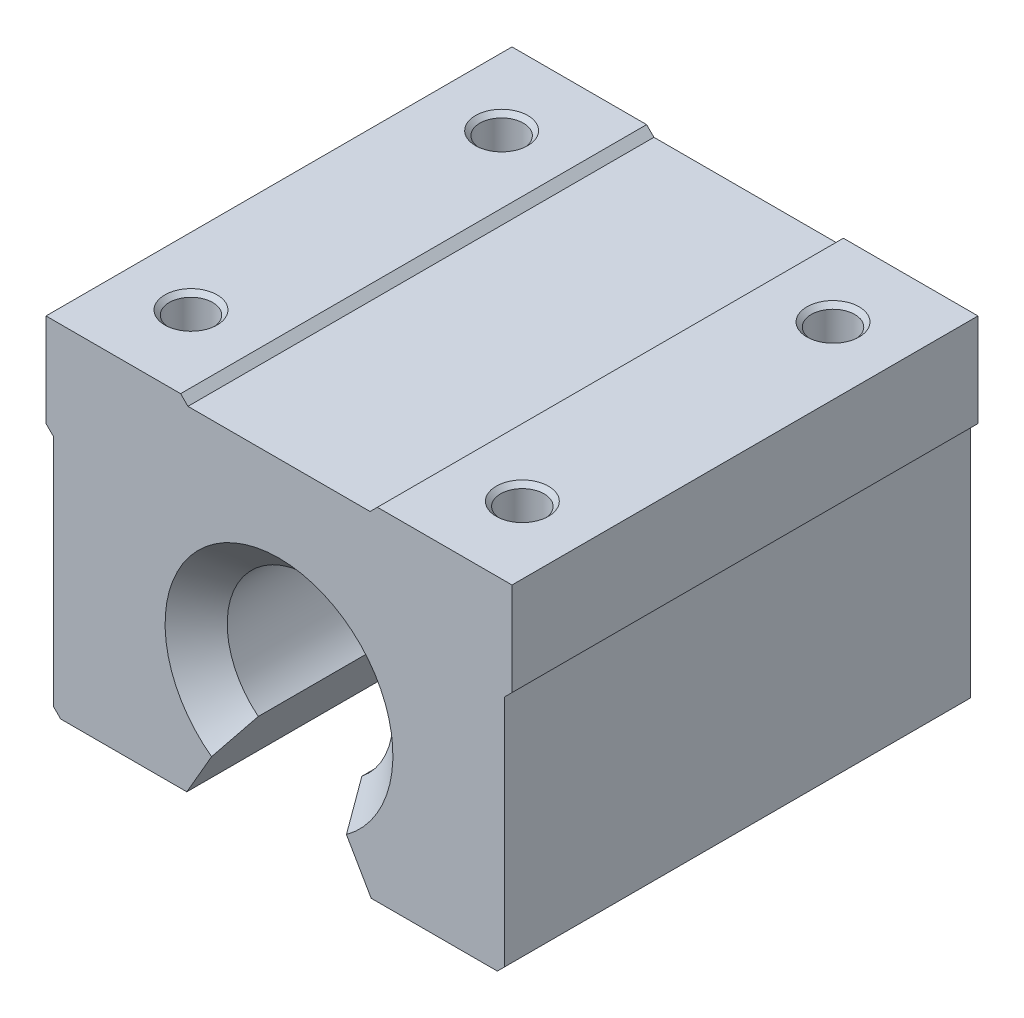
ISO-10303-21;
HEADER;
FILE_DESCRIPTION(('STEP AP214'),'2;1');
FILE_NAME('part.step','',(''),(''),'','','');
FILE_SCHEMA(('AUTOMOTIVE_DESIGN { 1 0 10303 214 1 1 1 1 }'));
ENDSEC;
DATA;
#1=APPLICATION_CONTEXT('core data for automotive mechanical design processes');
#2=APPLICATION_PROTOCOL_DEFINITION('international standard','automotive_design',2000,#1);
#3=PRODUCT_CONTEXT('',#1,'mechanical');
#4=PRODUCT('Part','Part','',(#3));
#5=PRODUCT_RELATED_PRODUCT_CATEGORY('part','',(#4));
#6=PRODUCT_DEFINITION_FORMATION('','',#4);
#7=PRODUCT_DEFINITION_CONTEXT('part definition',#1,'design');
#8=PRODUCT_DEFINITION('design','',#6,#7);
#9=PRODUCT_DEFINITION_SHAPE('','',#8);
#10=(LENGTH_UNIT() NAMED_UNIT(*) SI_UNIT(.MILLI.,.METRE.));
#11=(NAMED_UNIT(*) PLANE_ANGLE_UNIT() SI_UNIT($,.RADIAN.));
#12=(NAMED_UNIT(*) SI_UNIT($,.STERADIAN.) SOLID_ANGLE_UNIT());
#13=UNCERTAINTY_MEASURE_WITH_UNIT(LENGTH_MEASURE(1.E-05),#10,'distance_accuracy_value','');
#14=(GEOMETRIC_REPRESENTATION_CONTEXT(3) GLOBAL_UNCERTAINTY_ASSIGNED_CONTEXT((#13)) GLOBAL_UNIT_ASSIGNED_CONTEXT((#10,
#11,#12)) REPRESENTATION_CONTEXT('',''));
#15=CARTESIAN_POINT('',(0.,0.,0.));
#16=DIRECTION('',(0.,0.,1.));
#17=DIRECTION('',(1.,0.,0.));
#18=AXIS2_PLACEMENT_3D('',#15,#16,#17);
#19=CARTESIAN_POINT('',(-22.5,20.,22.5));
#20=DIRECTION('',(0.,-1.,0.));
#21=DIRECTION('',(0.,0.,-1.));
#22=AXIS2_PLACEMENT_3D('',#19,#20,#21);
#23=PLANE('',#22);
#24=CARTESIAN_POINT('',(-16.,20.,-15.));
#25=DIRECTION('',(0.,1.,0.));
#26=DIRECTION('',(0.,0.,1.));
#27=AXIS2_PLACEMENT_3D('',#24,#25,#26);
#28=CIRCLE('',#27,2.525);
#29=CARTESIAN_POINT('',(-16.,20.,-12.475));
#30=VERTEX_POINT('',#29);
#31=EDGE_CURVE('E220',#30,#30,#28,.T.);
#32=ORIENTED_EDGE('',*,*,#31,.F.);
#33=EDGE_LOOP('',(#32));
#34=FACE_BOUND('',#33,.T.);
#35=CARTESIAN_POINT('',(-16.,20.,15.));
#36=DIRECTION('',(0.,1.,0.));
#37=DIRECTION('',(0.,0.,1.));
#38=AXIS2_PLACEMENT_3D('',#35,#36,#37);
#39=CIRCLE('',#38,2.525);
#40=CARTESIAN_POINT('',(-16.,20.,17.525));
#41=VERTEX_POINT('',#40);
#42=EDGE_CURVE('E229',#41,#41,#39,.T.);
#43=ORIENTED_EDGE('',*,*,#42,.F.);
#44=EDGE_LOOP('',(#43));
#45=FACE_BOUND('',#44,.T.);
#46=DIRECTION('',(-1.,0.,0.));
#47=VECTOR('',#46,1.);
#48=CARTESIAN_POINT('',(-22.5,20.,-22.5));
#49=LINE('',#48,#47);
#50=CARTESIAN_POINT('',(-9.5,20.,-22.5));
#51=VERTEX_POINT('',#50);
#52=CARTESIAN_POINT('',(-22.5,20.,-22.5));
#53=VERTEX_POINT('',#52);
#54=EDGE_CURVE('E238',#51,#53,#49,.T.);
#55=ORIENTED_EDGE('',*,*,#54,.T.);
#56=DIRECTION('',(0.,0.,-1.));
#57=VECTOR('',#56,1.);
#58=CARTESIAN_POINT('',(-22.5,20.,22.5));
#59=LINE('',#58,#57);
#60=CARTESIAN_POINT('',(-22.5,20.,22.5));
#61=VERTEX_POINT('',#60);
#62=EDGE_CURVE('E359',#61,#53,#59,.T.);
#63=ORIENTED_EDGE('',*,*,#62,.F.);
#64=DIRECTION('',(-1.,0.,0.));
#65=VECTOR('',#64,1.);
#66=CARTESIAN_POINT('',(-22.5,20.,22.5));
#67=LINE('',#66,#65);
#68=CARTESIAN_POINT('',(-9.5,20.,22.5));
#69=VERTEX_POINT('',#68);
#70=EDGE_CURVE('E239',#69,#61,#67,.T.);
#71=ORIENTED_EDGE('',*,*,#70,.F.);
#72=DIRECTION('',(0.,0.,-1.));
#73=VECTOR('',#72,1.);
#74=CARTESIAN_POINT('',(-9.5,20.,22.5));
#75=LINE('',#74,#73);
#76=EDGE_CURVE('E275',#69,#51,#75,.T.);
#77=ORIENTED_EDGE('',*,*,#76,.T.);
#78=EDGE_LOOP('',(#55,#63,#71,#77));
#79=FACE_BOUND('',#78,.T.);
#80=ADVANCED_FACE('F41',(#34,#45,#79),#23,.F.);
#81=CARTESIAN_POINT('',(-22.5,20.,22.5));
#82=DIRECTION('',(1.,0.,0.));
#83=DIRECTION('',(0.,0.,-1.));
#84=AXIS2_PLACEMENT_3D('',#81,#82,#83);
#85=PLANE('',#84);
#86=DIRECTION('',(0.,-1.,0.));
#87=VECTOR('',#86,1.);
#88=CARTESIAN_POINT('',(-22.5,20.,-22.5));
#89=LINE('',#88,#87);
#90=CARTESIAN_POINT('',(-22.5,11.,-22.5));
#91=VERTEX_POINT('',#90);
#92=EDGE_CURVE('E278',#53,#91,#89,.T.);
#93=ORIENTED_EDGE('',*,*,#92,.T.);
#94=DIRECTION('',(0.,0.,-1.));
#95=VECTOR('',#94,1.);
#96=CARTESIAN_POINT('',(-22.5,11.,22.5));
#97=LINE('',#96,#95);
#98=CARTESIAN_POINT('',(-22.5,11.,22.5));
#99=VERTEX_POINT('',#98);
#100=EDGE_CURVE('E356',#99,#91,#97,.T.);
#101=ORIENTED_EDGE('',*,*,#100,.F.);
#102=DIRECTION('',(0.,-1.,0.));
#103=VECTOR('',#102,1.);
#104=CARTESIAN_POINT('',(-22.5,20.,22.5));
#105=LINE('',#104,#103);
#106=EDGE_CURVE('E242',#61,#99,#105,.T.);
#107=ORIENTED_EDGE('',*,*,#106,.F.);
#108=ORIENTED_EDGE('',*,*,#62,.T.);
#109=EDGE_LOOP('',(#93,#101,#107,#108));
#110=FACE_BOUND('',#109,.T.);
#111=ADVANCED_FACE('F421',(#110),#85,.F.);
#112=CARTESIAN_POINT('',(-22.5,11.,22.5));
#113=DIRECTION('',(0.707106781186546,0.707106781186549,0.));
#114=DIRECTION('',(-0.707106781186549,0.707106781186546,0.));
#115=AXIS2_PLACEMENT_3D('',#112,#113,#114);
#116=PLANE('',#115);
#117=DIRECTION('',(0.707106781186549,-0.707106781186546,0.));
#118=VECTOR('',#117,1.);
#119=CARTESIAN_POINT('',(-22.5,11.,-22.5));
#120=LINE('',#119,#118);
#121=CARTESIAN_POINT('',(-21.7928932188135,10.2928932188135,-22.5));
#122=VERTEX_POINT('',#121);
#123=EDGE_CURVE('E280',#91,#122,#120,.T.);
#124=ORIENTED_EDGE('',*,*,#123,.T.);
#125=DIRECTION('',(0.,0.,-1.));
#126=VECTOR('',#125,1.);
#127=CARTESIAN_POINT('',(-21.7928932188135,10.2928932188135,22.5));
#128=LINE('',#127,#126);
#129=CARTESIAN_POINT('',(-21.7928932188135,10.2928932188135,22.5));
#130=VERTEX_POINT('',#129);
#131=EDGE_CURVE('E353',#130,#122,#128,.T.);
#132=ORIENTED_EDGE('',*,*,#131,.F.);
#133=DIRECTION('',(0.707106781186549,-0.707106781186546,0.));
#134=VECTOR('',#133,1.);
#135=CARTESIAN_POINT('',(-22.5,11.,22.5));
#136=LINE('',#135,#134);
#137=EDGE_CURVE('E245',#99,#130,#136,.T.);
#138=ORIENTED_EDGE('',*,*,#137,.F.);
#139=ORIENTED_EDGE('',*,*,#100,.T.);
#140=EDGE_LOOP('',(#124,#132,#138,#139));
#141=FACE_BOUND('',#140,.T.);
#142=ADVANCED_FACE('F425',(#141),#116,.F.);
#143=CARTESIAN_POINT('',(-21.7928932188135,10.2928932188135,22.5));
#144=DIRECTION('',(1.,0.,0.));
#145=DIRECTION('',(0.,1.,0.));
#146=AXIS2_PLACEMENT_3D('',#143,#144,#145);
#147=PLANE('',#146);
#148=DIRECTION('',(0.,-1.,0.));
#149=VECTOR('',#148,1.);
#150=CARTESIAN_POINT('',(-21.7928932188135,10.2928932188135,-22.5));
#151=LINE('',#150,#149);
#152=CARTESIAN_POINT('',(-21.7928932188134,-12.2928932188135,-22.5));
#153=VERTEX_POINT('',#152);
#154=EDGE_CURVE('E282',#122,#153,#151,.T.);
#155=ORIENTED_EDGE('',*,*,#154,.T.);
#156=DIRECTION('',(0.,0.,-1.));
#157=VECTOR('',#156,1.);
#158=CARTESIAN_POINT('',(-21.7928932188134,-12.2928932188135,22.5));
#159=LINE('',#158,#157);
#160=CARTESIAN_POINT('',(-21.7928932188134,-12.2928932188135,22.5));
#161=VERTEX_POINT('',#160);
#162=EDGE_CURVE('E350',#161,#153,#159,.T.);
#163=ORIENTED_EDGE('',*,*,#162,.F.);
#164=DIRECTION('',(0.,-1.,0.));
#165=VECTOR('',#164,1.);
#166=CARTESIAN_POINT('',(-21.7928932188135,10.2928932188135,22.5));
#167=LINE('',#166,#165);
#168=EDGE_CURVE('E247',#130,#161,#167,.T.);
#169=ORIENTED_EDGE('',*,*,#168,.F.);
#170=ORIENTED_EDGE('',*,*,#131,.T.);
#171=EDGE_LOOP('',(#155,#163,#169,#170));
#172=FACE_BOUND('',#171,.T.);
#173=ADVANCED_FACE('F429',(#172),#147,.F.);
#174=CARTESIAN_POINT('',(-21.7928932188134,-12.2928932188135,22.5));
#175=DIRECTION('',(0.707106781186542,0.707106781186553,0.));
#176=DIRECTION('',(-0.707106781186553,0.707106781186542,0.));
#177=AXIS2_PLACEMENT_3D('',#174,#175,#176);
#178=PLANE('',#177);
#179=DIRECTION('',(0.707106781186553,-0.707106781186542,0.));
#180=VECTOR('',#179,1.);
#181=CARTESIAN_POINT('',(-21.7928932188134,-12.2928932188135,-22.5));
#182=LINE('',#181,#180);
#183=CARTESIAN_POINT('',(-21.0857864376269,-13.,-22.5));
#184=VERTEX_POINT('',#183);
#185=EDGE_CURVE('E284',#153,#184,#182,.T.);
#186=ORIENTED_EDGE('',*,*,#185,.T.);
#187=DIRECTION('',(0.,0.,-1.));
#188=VECTOR('',#187,1.);
#189=CARTESIAN_POINT('',(-21.0857864376269,-13.,22.5));
#190=LINE('',#189,#188);
#191=CARTESIAN_POINT('',(-21.0857864376269,-13.,22.5));
#192=VERTEX_POINT('',#191);
#193=EDGE_CURVE('E347',#192,#184,#190,.T.);
#194=ORIENTED_EDGE('',*,*,#193,.F.);
#195=DIRECTION('',(0.707106781186553,-0.707106781186542,0.));
#196=VECTOR('',#195,1.);
#197=CARTESIAN_POINT('',(-21.7928932188134,-12.2928932188135,22.5));
#198=LINE('',#197,#196);
#199=EDGE_CURVE('E249',#161,#192,#198,.T.);
#200=ORIENTED_EDGE('',*,*,#199,.F.);
#201=ORIENTED_EDGE('',*,*,#162,.T.);
#202=EDGE_LOOP('',(#186,#194,#200,#201));
#203=FACE_BOUND('',#202,.T.);
#204=ADVANCED_FACE('F432',(#203),#178,.F.);
#205=CARTESIAN_POINT('',(-21.0857864376269,-13.,22.5));
#206=DIRECTION('',(0.,1.,0.));
#207=DIRECTION('',(-1.,0.,0.));
#208=AXIS2_PLACEMENT_3D('',#205,#206,#207);
#209=PLANE('',#208);
#210=DIRECTION('',(1.,0.,0.));
#211=VECTOR('',#210,1.);
#212=CARTESIAN_POINT('',(-21.0857864376269,-13.,-22.5));
#213=LINE('',#212,#211);
#214=CARTESIAN_POINT('',(-8.90000222400116,-13.,-22.5));
#215=VERTEX_POINT('',#214);
#216=EDGE_CURVE('E286',#184,#215,#213,.T.);
#217=ORIENTED_EDGE('',*,*,#216,.T.);
#218=DIRECTION('',(0.,0.,-1.));
#219=VECTOR('',#218,1.);
#220=CARTESIAN_POINT('',(-8.90000222400116,-13.,22.5));
#221=LINE('',#220,#219);
#222=CARTESIAN_POINT('',(-8.90000222400116,-13.,22.5));
#223=VERTEX_POINT('',#222);
#224=EDGE_CURVE('E344',#223,#215,#221,.T.);
#225=ORIENTED_EDGE('',*,*,#224,.F.);
#226=DIRECTION('',(1.,0.,0.));
#227=VECTOR('',#226,1.);
#228=CARTESIAN_POINT('',(-21.0857864376269,-13.,22.5));
#229=LINE('',#228,#227);
#230=EDGE_CURVE('E251',#192,#223,#229,.T.);
#231=ORIENTED_EDGE('',*,*,#230,.F.);
#232=ORIENTED_EDGE('',*,*,#193,.T.);
#233=EDGE_LOOP('',(#217,#225,#231,#232));
#234=FACE_BOUND('',#233,.T.);
#235=ADVANCED_FACE('F397',(#234),#209,.F.);
#236=CARTESIAN_POINT('',(-8.90000222400116,-13.,22.5));
#237=DIRECTION('',(-0.866025403784438,0.500000000000001,0.));
#238=DIRECTION('',(-0.500000000000001,-0.866025403784438,0.));
#239=AXIS2_PLACEMENT_3D('',#236,#237,#238);
#240=PLANE('',#239);
#241=DIRECTION('',(0.500000000000001,0.866025403784438,0.));
#242=VECTOR('',#241,1.);
#243=CARTESIAN_POINT('',(-8.90000222400116,-13.,-22.5));
#244=LINE('',#243,#242);
#245=CARTESIAN_POINT('',(-6.51259139811201,-8.86488315102003,-22.5));
#246=VERTEX_POINT('',#245);
#247=EDGE_CURVE('E288',#215,#246,#244,.T.);
#248=ORIENTED_EDGE('',*,*,#247,.T.);
#249=CARTESIAN_POINT('',(-6.51259139811201,-8.86488315102003,-22.5));
#250=CARTESIAN_POINT('',(-6.38668504007308,-8.64680694190066,-22.2497118828855));
#251=CARTESIAN_POINT('',(-6.26075386517851,-8.42868774872641,-21.9994736753837));
#252=CARTESIAN_POINT('',(-6.00882674626239,-7.99233717895925,-21.4991279368277));
#253=CARTESIAN_POINT('',(-5.88283080226974,-7.77410580241637,-21.2490204057154));
#254=CARTESIAN_POINT('',(-5.63075887329718,-7.33750441427402,-20.7489666059144));
#255=CARTESIAN_POINT('',(-5.50468288830189,-7.11913440264788,-20.4990203372568));
#256=CARTESIAN_POINT('',(-5.25242616501369,-6.68221294136187,-19.999339119979));
#257=CARTESIAN_POINT('',(-5.12624542667377,-6.46366149162057,-19.7496041714537));
#258=CARTESIAN_POINT('',(-5.,-6.2449979983984,-19.5));
#259=B_SPLINE_CURVE_WITH_KNOTS('',3,(#249,#250,#251,#252,#253,#254,#255,#256,#257,#258),
.UNSPECIFIED.,.F.,.F.,(4,2,2,2,4),(0.,1.06512164089084,2.13024280709936,3.19536417823267,
4.26048602769983),.UNSPECIFIED.);
#260=CARTESIAN_POINT('',(-5.,-6.2449979983984,-19.4999999999999));
#261=VERTEX_POINT('',#260);
#262=EDGE_CURVE('E51',#246,#261,#259,.T.);
#263=ORIENTED_EDGE('',*,*,#262,.T.);
#264=DIRECTION('',(0.,0.,-1.));
#265=VECTOR('',#264,1.);
#266=CARTESIAN_POINT('',(-5.,-6.2449979983984,22.5));
#267=LINE('',#266,#265);
#268=CARTESIAN_POINT('',(-5.,-6.2449979983984,19.5));
#269=VERTEX_POINT('',#268);
#270=EDGE_CURVE('E341',#269,#261,#267,.T.);
#271=ORIENTED_EDGE('',*,*,#270,.F.);
#272=CARTESIAN_POINT('',(-5.,-6.2449979983984,19.5));
#273=CARTESIAN_POINT('',(-5.12624542667376,-6.46366149162056,19.7496041714537));
#274=CARTESIAN_POINT('',(-5.25242616501368,-6.68221294136186,19.999339119979));
#275=CARTESIAN_POINT('',(-5.50468288830188,-7.11913440264785,20.4990203372568));
#276=CARTESIAN_POINT('',(-5.63075887329716,-7.33750441427398,20.7489666059144));
#277=CARTESIAN_POINT('',(-5.88283080226971,-7.77410580241632,21.2490204057154));
#278=CARTESIAN_POINT('',(-6.00882674626236,-7.99233717895919,21.4991279368278));
#279=CARTESIAN_POINT('',(-6.26075386517847,-8.42868774872634,21.9994736753837));
#280=CARTESIAN_POINT('',(-6.38668504007304,-8.64680694190058,22.2497118828855));
#281=CARTESIAN_POINT('',(-6.51259139811196,-8.86488315101994,22.5));
#282=B_SPLINE_CURVE_WITH_KNOTS('',3,(#272,#273,#274,#275,#276,#277,#278,#279,#280,#281),
.UNSPECIFIED.,.F.,.F.,(4,2,2,2,4),(0.,1.06512184946713,2.13024322060042,3.1953643868089,
4.26048602769971),.UNSPECIFIED.);
#283=CARTESIAN_POINT('',(-6.51259139811196,-8.86488315101994,22.5));
#284=VERTEX_POINT('',#283);
#285=EDGE_CURVE('E58',#269,#284,#282,.T.);
#286=ORIENTED_EDGE('',*,*,#285,.T.);
#287=DIRECTION('',(0.500000000000001,0.866025403784438,0.));
#288=VECTOR('',#287,1.);
#289=CARTESIAN_POINT('',(-8.90000222400116,-13.,22.5));
#290=LINE('',#289,#288);
#291=EDGE_CURVE('E253',#223,#284,#290,.T.);
#292=ORIENTED_EDGE('',*,*,#291,.F.);
#293=ORIENTED_EDGE('',*,*,#224,.T.);
#294=EDGE_LOOP('',(#248,#263,#271,#286,#292,#293));
#295=FACE_BOUND('',#294,.T.);
#296=ADVANCED_FACE('F392',(#295),#240,.F.);
#297=CARTESIAN_POINT('',(0.,0.,22.5));
#298=DIRECTION('',(0.,0.,-1.));
#299=DIRECTION('',(-1.,0.,0.));
#300=AXIS2_PLACEMENT_3D('',#297,#298,#299);
#301=CYLINDRICAL_SURFACE('',#300,8.);
#302=ORIENTED_EDGE('',*,*,#270,.T.);
#303=CARTESIAN_POINT('',(0.,0.,-19.5));
#304=DIRECTION('',(0.,0.,1.));
#305=DIRECTION('',(1.,0.,0.));
#306=AXIS2_PLACEMENT_3D('',#303,#304,#305);
#307=CIRCLE('',#306,8.);
#308=CARTESIAN_POINT('',(5.,-6.2449979983984,-19.4999999999999));
#309=VERTEX_POINT('',#308);
#310=EDGE_CURVE('E364',#261,#309,#307,.F.);
#311=ORIENTED_EDGE('',*,*,#310,.T.);
#312=DIRECTION('',(0.,0.,-1.));
#313=VECTOR('',#312,1.);
#314=CARTESIAN_POINT('',(5.,-6.2449979983984,22.5));
#315=LINE('',#314,#313);
#316=CARTESIAN_POINT('',(5.,-6.2449979983984,19.5));
#317=VERTEX_POINT('',#316);
#318=EDGE_CURVE('E338',#317,#309,#315,.T.);
#319=ORIENTED_EDGE('',*,*,#318,.F.);
#320=CARTESIAN_POINT('',(0.,0.,19.5));
#321=DIRECTION('',(0.,0.,1.));
#322=DIRECTION('',(1.,0.,0.));
#323=AXIS2_PLACEMENT_3D('',#320,#321,#322);
#324=CIRCLE('',#323,8.);
#325=EDGE_CURVE('E362',#317,#269,#324,.T.);
#326=ORIENTED_EDGE('',*,*,#325,.T.);
#327=EDGE_LOOP('',(#302,#311,#319,#326));
#328=FACE_BOUND('',#327,.T.);
#329=ADVANCED_FACE('F386',(#328),#301,.F.);
#330=CARTESIAN_POINT('',(8.90000222400116,-13.,22.5));
#331=DIRECTION('',(0.866025403784438,0.500000000000001,0.));
#332=DIRECTION('',(-0.500000000000001,0.866025403784438,0.));
#333=AXIS2_PLACEMENT_3D('',#330,#331,#332);
#334=PLANE('',#333);
#335=ORIENTED_EDGE('',*,*,#318,.T.);
#336=CARTESIAN_POINT('',(5.,-6.2449979983984,-19.5));
#337=CARTESIAN_POINT('',(5.12624542667376,-6.46366149162057,-19.7496041714537));
#338=CARTESIAN_POINT('',(5.25242616501369,-6.68221294136187,-19.999339119979));
#339=CARTESIAN_POINT('',(5.50468288830189,-7.11913440264788,-20.4990203372568));
#340=CARTESIAN_POINT('',(5.63075887329718,-7.33750441427402,-20.7489666059144));
#341=CARTESIAN_POINT('',(5.88283080226974,-7.77410580241637,-21.2490204057154));
#342=CARTESIAN_POINT('',(6.00882674626239,-7.99233717895925,-21.4991279368277));
#343=CARTESIAN_POINT('',(6.26075386517851,-8.42868774872641,-21.9994736753837));
#344=CARTESIAN_POINT('',(6.38668504007309,-8.64680694190066,-22.2497118828855));
#345=CARTESIAN_POINT('',(6.51259139811201,-8.86488315102003,-22.5));
#346=B_SPLINE_CURVE_WITH_KNOTS('',3,(#336,#337,#338,#339,#340,#341,#342,#343,#344,#345),
.UNSPECIFIED.,.F.,.F.,(4,2,2,2,4),(0.,1.06512184946717,2.13024322060048,3.19536438680899,
4.26048602769984),.UNSPECIFIED.);
#347=CARTESIAN_POINT('',(6.51259139811201,-8.86488315102003,-22.5));
#348=VERTEX_POINT('',#347);
#349=EDGE_CURVE('E374',#309,#348,#346,.T.);
#350=ORIENTED_EDGE('',*,*,#349,.T.);
#351=DIRECTION('',(0.500000000000001,-0.866025403784438,0.));
#352=VECTOR('',#351,1.);
#353=CARTESIAN_POINT('',(8.90000222400116,-13.,-22.5));
#354=LINE('',#353,#352);
#355=CARTESIAN_POINT('',(8.90000222400116,-13.,-22.5));
#356=VERTEX_POINT('',#355);
#357=EDGE_CURVE('E290',#348,#356,#354,.T.);
#358=ORIENTED_EDGE('',*,*,#357,.T.);
#359=DIRECTION('',(0.,0.,-1.));
#360=VECTOR('',#359,1.);
#361=CARTESIAN_POINT('',(8.90000222400116,-13.,22.5));
#362=LINE('',#361,#360);
#363=CARTESIAN_POINT('',(8.90000222400116,-13.,22.5));
#364=VERTEX_POINT('',#363);
#365=EDGE_CURVE('E335',#364,#356,#362,.T.);
#366=ORIENTED_EDGE('',*,*,#365,.F.);
#367=DIRECTION('',(0.500000000000001,-0.866025403784438,0.));
#368=VECTOR('',#367,1.);
#369=CARTESIAN_POINT('',(8.90000222400116,-13.,22.5));
#370=LINE('',#369,#368);
#371=CARTESIAN_POINT('',(6.51259139811196,-8.86488315101994,22.5));
#372=VERTEX_POINT('',#371);
#373=EDGE_CURVE('E255',#372,#364,#370,.T.);
#374=ORIENTED_EDGE('',*,*,#373,.F.);
#375=CARTESIAN_POINT('',(6.51259139811196,-8.86488315101994,22.5));
#376=CARTESIAN_POINT('',(6.38668504007304,-8.64680694190058,22.2497118828855));
#377=CARTESIAN_POINT('',(6.26075386517847,-8.42868774872634,21.9994736753837));
#378=CARTESIAN_POINT('',(6.00882674626236,-7.99233717895919,21.4991279368278));
#379=CARTESIAN_POINT('',(5.88283080226971,-7.77410580241632,21.2490204057154));
#380=CARTESIAN_POINT('',(5.63075887329716,-7.33750441427398,20.7489666059144));
#381=CARTESIAN_POINT('',(5.50468288830187,-7.11913440264785,20.4990203372568));
#382=CARTESIAN_POINT('',(5.25242616501368,-6.68221294136186,19.999339119979));
#383=CARTESIAN_POINT('',(5.12624542667376,-6.46366149162056,19.7496041714537));
#384=CARTESIAN_POINT('',(5.,-6.2449979983984,19.5));
#385=B_SPLINE_CURVE_WITH_KNOTS('',3,(#375,#376,#377,#378,#379,#380,#381,#382,#383,#384),
.UNSPECIFIED.,.F.,.F.,(4,2,2,2,4),(0.,1.06512164089081,2.1302428070993,3.19536417823258,
4.26048602769971),.UNSPECIFIED.);
#386=EDGE_CURVE('E367',#372,#317,#385,.T.);
#387=ORIENTED_EDGE('',*,*,#386,.T.);
#388=EDGE_LOOP('',(#335,#350,#358,#366,#374,#387));
#389=FACE_BOUND('',#388,.T.);
#390=ADVANCED_FACE('F380',(#389),#334,.F.);
#391=CARTESIAN_POINT('',(21.0857864376269,-13.,22.5));
#392=DIRECTION('',(0.,1.,0.));
#393=DIRECTION('',(-1.,0.,0.));
#394=AXIS2_PLACEMENT_3D('',#391,#392,#393);
#395=PLANE('',#394);
#396=DIRECTION('',(1.,0.,0.));
#397=VECTOR('',#396,1.);
#398=CARTESIAN_POINT('',(21.0857864376269,-13.,-22.5));
#399=LINE('',#398,#397);
#400=CARTESIAN_POINT('',(21.0857864376269,-13.,-22.5));
#401=VERTEX_POINT('',#400);
#402=EDGE_CURVE('E292',#356,#401,#399,.T.);
#403=ORIENTED_EDGE('',*,*,#402,.T.);
#404=DIRECTION('',(0.,0.,-1.));
#405=VECTOR('',#404,1.);
#406=CARTESIAN_POINT('',(21.0857864376269,-13.,22.5));
#407=LINE('',#406,#405);
#408=CARTESIAN_POINT('',(21.0857864376269,-13.,22.5));
#409=VERTEX_POINT('',#408);
#410=EDGE_CURVE('E332',#409,#401,#407,.T.);
#411=ORIENTED_EDGE('',*,*,#410,.F.);
#412=DIRECTION('',(1.,0.,0.));
#413=VECTOR('',#412,1.);
#414=CARTESIAN_POINT('',(21.0857864376269,-13.,22.5));
#415=LINE('',#414,#413);
#416=EDGE_CURVE('E257',#364,#409,#415,.T.);
#417=ORIENTED_EDGE('',*,*,#416,.F.);
#418=ORIENTED_EDGE('',*,*,#365,.T.);
#419=EDGE_LOOP('',(#403,#411,#417,#418));
#420=FACE_BOUND('',#419,.T.);
#421=ADVANCED_FACE('F385',(#420),#395,.F.);
#422=CARTESIAN_POINT('',(21.7928932188134,-12.2928932188135,22.5));
#423=DIRECTION('',(-0.707106781186544,0.707106781186551,0.));
#424=DIRECTION('',(-0.707106781186551,-0.707106781186544,0.));
#425=AXIS2_PLACEMENT_3D('',#422,#423,#424);
#426=PLANE('',#425);
#427=DIRECTION('',(0.707106781186551,0.707106781186544,0.));
#428=VECTOR('',#427,1.);
#429=CARTESIAN_POINT('',(21.7928932188134,-12.2928932188135,-22.5));
#430=LINE('',#429,#428);
#431=CARTESIAN_POINT('',(21.7928932188134,-12.2928932188135,-22.5));
#432=VERTEX_POINT('',#431);
#433=EDGE_CURVE('E294',#401,#432,#430,.T.);
#434=ORIENTED_EDGE('',*,*,#433,.T.);
#435=DIRECTION('',(0.,0.,-1.));
#436=VECTOR('',#435,1.);
#437=CARTESIAN_POINT('',(21.7928932188134,-12.2928932188135,22.5));
#438=LINE('',#437,#436);
#439=CARTESIAN_POINT('',(21.7928932188134,-12.2928932188135,22.5));
#440=VERTEX_POINT('',#439);
#441=EDGE_CURVE('E329',#440,#432,#438,.T.);
#442=ORIENTED_EDGE('',*,*,#441,.F.);
#443=DIRECTION('',(0.707106781186551,0.707106781186544,0.));
#444=VECTOR('',#443,1.);
#445=CARTESIAN_POINT('',(21.7928932188134,-12.2928932188135,22.5));
#446=LINE('',#445,#444);
#447=EDGE_CURVE('E259',#409,#440,#446,.T.);
#448=ORIENTED_EDGE('',*,*,#447,.F.);
#449=ORIENTED_EDGE('',*,*,#410,.T.);
#450=EDGE_LOOP('',(#434,#442,#448,#449));
#451=FACE_BOUND('',#450,.T.);
#452=ADVANCED_FACE('F508',(#451),#426,.F.);
#453=CARTESIAN_POINT('',(21.7928932188135,10.2928932188135,22.5));
#454=DIRECTION('',(-1.,0.,0.));
#455=DIRECTION('',(0.,-1.,0.));
#456=AXIS2_PLACEMENT_3D('',#453,#454,#455);
#457=PLANE('',#456);
#458=DIRECTION('',(0.,1.,0.));
#459=VECTOR('',#458,1.);
#460=CARTESIAN_POINT('',(21.7928932188135,10.2928932188135,-22.5));
#461=LINE('',#460,#459);
#462=CARTESIAN_POINT('',(21.7928932188135,10.2928932188135,-22.5));
#463=VERTEX_POINT('',#462);
#464=EDGE_CURVE('E296',#432,#463,#461,.T.);
#465=ORIENTED_EDGE('',*,*,#464,.T.);
#466=DIRECTION('',(0.,0.,-1.));
#467=VECTOR('',#466,1.);
#468=CARTESIAN_POINT('',(21.7928932188135,10.2928932188135,22.5));
#469=LINE('',#468,#467);
#470=CARTESIAN_POINT('',(21.7928932188135,10.2928932188135,22.5));
#471=VERTEX_POINT('',#470);
#472=EDGE_CURVE('E326',#471,#463,#469,.T.);
#473=ORIENTED_EDGE('',*,*,#472,.F.);
#474=DIRECTION('',(0.,1.,0.));
#475=VECTOR('',#474,1.);
#476=CARTESIAN_POINT('',(21.7928932188135,10.2928932188135,22.5));
#477=LINE('',#476,#475);
#478=EDGE_CURVE('E261',#440,#471,#477,.T.);
#479=ORIENTED_EDGE('',*,*,#478,.F.);
#480=ORIENTED_EDGE('',*,*,#441,.T.);
#481=EDGE_LOOP('',(#465,#473,#479,#480));
#482=FACE_BOUND('',#481,.T.);
#483=ADVANCED_FACE('F503',(#482),#457,.F.);
#484=CARTESIAN_POINT('',(22.5,11.,22.5));
#485=DIRECTION('',(-0.707106781186546,0.707106781186549,0.));
#486=DIRECTION('',(-0.707106781186549,-0.707106781186546,0.));
#487=AXIS2_PLACEMENT_3D('',#484,#485,#486);
#488=PLANE('',#487);
#489=DIRECTION('',(0.707106781186549,0.707106781186546,0.));
#490=VECTOR('',#489,1.);
#491=CARTESIAN_POINT('',(22.5,11.,-22.5));
#492=LINE('',#491,#490);
#493=CARTESIAN_POINT('',(22.5,11.,-22.5));
#494=VERTEX_POINT('',#493);
#495=EDGE_CURVE('E298',#463,#494,#492,.T.);
#496=ORIENTED_EDGE('',*,*,#495,.T.);
#497=DIRECTION('',(0.,0.,-1.));
#498=VECTOR('',#497,1.);
#499=CARTESIAN_POINT('',(22.5,11.,22.5));
#500=LINE('',#499,#498);
#501=CARTESIAN_POINT('',(22.5,11.,22.5));
#502=VERTEX_POINT('',#501);
#503=EDGE_CURVE('E323',#502,#494,#500,.T.);
#504=ORIENTED_EDGE('',*,*,#503,.F.);
#505=DIRECTION('',(0.707106781186549,0.707106781186546,0.));
#506=VECTOR('',#505,1.);
#507=CARTESIAN_POINT('',(22.5,11.,22.5));
#508=LINE('',#507,#506);
#509=EDGE_CURVE('E263',#471,#502,#508,.T.);
#510=ORIENTED_EDGE('',*,*,#509,.F.);
#511=ORIENTED_EDGE('',*,*,#472,.T.);
#512=EDGE_LOOP('',(#496,#504,#510,#511));
#513=FACE_BOUND('',#512,.T.);
#514=ADVANCED_FACE('F497',(#513),#488,.F.);
#515=CARTESIAN_POINT('',(22.5,20.,22.5));
#516=DIRECTION('',(-1.,0.,0.));
#517=DIRECTION('',(0.,0.,1.));
#518=AXIS2_PLACEMENT_3D('',#515,#516,#517);
#519=PLANE('',#518);
#520=DIRECTION('',(0.,1.,0.));
#521=VECTOR('',#520,1.);
#522=CARTESIAN_POINT('',(22.5,20.,-22.5));
#523=LINE('',#522,#521);
#524=CARTESIAN_POINT('',(22.5,20.,-22.5));
#525=VERTEX_POINT('',#524);
#526=EDGE_CURVE('E300',#494,#525,#523,.T.);
#527=ORIENTED_EDGE('',*,*,#526,.T.);
#528=DIRECTION('',(0.,0.,-1.));
#529=VECTOR('',#528,1.);
#530=CARTESIAN_POINT('',(22.5,20.,22.5));
#531=LINE('',#530,#529);
#532=CARTESIAN_POINT('',(22.5,20.,22.5));
#533=VERTEX_POINT('',#532);
#534=EDGE_CURVE('E320',#533,#525,#531,.T.);
#535=ORIENTED_EDGE('',*,*,#534,.F.);
#536=DIRECTION('',(0.,1.,0.));
#537=VECTOR('',#536,1.);
#538=CARTESIAN_POINT('',(22.5,20.,22.5));
#539=LINE('',#538,#537);
#540=EDGE_CURVE('E265',#502,#533,#539,.T.);
#541=ORIENTED_EDGE('',*,*,#540,.F.);
#542=ORIENTED_EDGE('',*,*,#503,.T.);
#543=EDGE_LOOP('',(#527,#535,#541,#542));
#544=FACE_BOUND('',#543,.T.);
#545=ADVANCED_FACE('F493',(#544),#519,.F.);
#546=CARTESIAN_POINT('',(22.5,20.,22.5));
#547=DIRECTION('',(0.,-1.,0.));
#548=DIRECTION('',(0.,0.,-1.));
#549=AXIS2_PLACEMENT_3D('',#546,#547,#548);
#550=PLANE('',#549);
#551=CARTESIAN_POINT('',(16.,20.,15.));
#552=DIRECTION('',(0.,1.,0.));
#553=DIRECTION('',(0.,0.,1.));
#554=AXIS2_PLACEMENT_3D('',#551,#552,#553);
#555=CIRCLE('',#554,2.525);
#556=CARTESIAN_POINT('',(16.,20.,17.525));
#557=VERTEX_POINT('',#556);
#558=EDGE_CURVE('E211',#557,#557,#555,.T.);
#559=ORIENTED_EDGE('',*,*,#558,.F.);
#560=EDGE_LOOP('',(#559));
#561=FACE_BOUND('',#560,.T.);
#562=CARTESIAN_POINT('',(16.,20.,-15.));
#563=DIRECTION('',(0.,1.,0.));
#564=DIRECTION('',(0.,0.,1.));
#565=AXIS2_PLACEMENT_3D('',#562,#563,#564);
#566=CIRCLE('',#565,2.525);
#567=CARTESIAN_POINT('',(16.,20.,-12.475));
#568=VERTEX_POINT('',#567);
#569=EDGE_CURVE('E204',#568,#568,#566,.T.);
#570=ORIENTED_EDGE('',*,*,#569,.F.);
#571=EDGE_LOOP('',(#570));
#572=FACE_BOUND('',#571,.T.);
#573=DIRECTION('',(-1.,0.,0.));
#574=VECTOR('',#573,1.);
#575=CARTESIAN_POINT('',(22.5,20.,-22.5));
#576=LINE('',#575,#574);
#577=CARTESIAN_POINT('',(9.5,20.,-22.5));
#578=VERTEX_POINT('',#577);
#579=EDGE_CURVE('E302',#525,#578,#576,.T.);
#580=ORIENTED_EDGE('',*,*,#579,.T.);
#581=DIRECTION('',(0.,0.,-1.));
#582=VECTOR('',#581,1.);
#583=CARTESIAN_POINT('',(9.5,20.,22.5));
#584=LINE('',#583,#582);
#585=CARTESIAN_POINT('',(9.5,20.,22.5));
#586=VERTEX_POINT('',#585);
#587=EDGE_CURVE('E317',#586,#578,#584,.T.);
#588=ORIENTED_EDGE('',*,*,#587,.F.);
#589=DIRECTION('',(-1.,0.,0.));
#590=VECTOR('',#589,1.);
#591=CARTESIAN_POINT('',(22.5,20.,22.5));
#592=LINE('',#591,#590);
#593=EDGE_CURVE('E267',#533,#586,#592,.T.);
#594=ORIENTED_EDGE('',*,*,#593,.F.);
#595=ORIENTED_EDGE('',*,*,#534,.T.);
#596=EDGE_LOOP('',(#580,#588,#594,#595));
#597=FACE_BOUND('',#596,.T.);
#598=ADVANCED_FACE('F488',(#561,#572,#597),#550,.F.);
#599=CARTESIAN_POINT('',(9.5,20.,22.5));
#600=DIRECTION('',(0.707106781186547,-0.707106781186548,0.));
#601=DIRECTION('',(0.707106781186548,0.707106781186547,0.));
#602=AXIS2_PLACEMENT_3D('',#599,#600,#601);
#603=PLANE('',#602);
#604=DIRECTION('',(-0.707106781186548,-0.707106781186547,0.));
#605=VECTOR('',#604,1.);
#606=CARTESIAN_POINT('',(9.5,20.,-22.5));
#607=LINE('',#606,#605);
#608=CARTESIAN_POINT('',(8.79289321881345,19.2928932188134,-22.5));
#609=VERTEX_POINT('',#608);
#610=EDGE_CURVE('E304',#578,#609,#607,.T.);
#611=ORIENTED_EDGE('',*,*,#610,.T.);
#612=DIRECTION('',(0.,0.,-1.));
#613=VECTOR('',#612,1.);
#614=CARTESIAN_POINT('',(8.79289321881345,19.2928932188134,22.5));
#615=LINE('',#614,#613);
#616=CARTESIAN_POINT('',(8.79289321881345,19.2928932188134,22.5));
#617=VERTEX_POINT('',#616);
#618=EDGE_CURVE('E314',#617,#609,#615,.T.);
#619=ORIENTED_EDGE('',*,*,#618,.F.);
#620=DIRECTION('',(-0.707106781186548,-0.707106781186547,0.));
#621=VECTOR('',#620,1.);
#622=CARTESIAN_POINT('',(9.5,20.,22.5));
#623=LINE('',#622,#621);
#624=EDGE_CURVE('E269',#586,#617,#623,.T.);
#625=ORIENTED_EDGE('',*,*,#624,.F.);
#626=ORIENTED_EDGE('',*,*,#587,.T.);
#627=EDGE_LOOP('',(#611,#619,#625,#626));
#628=FACE_BOUND('',#627,.T.);
#629=ADVANCED_FACE('F482',(#628),#603,.F.);
#630=CARTESIAN_POINT('',(-8.79289321881345,19.2928932188134,22.5));
#631=DIRECTION('',(0.,-1.,0.));
#632=DIRECTION('',(0.,0.,-1.));
#633=AXIS2_PLACEMENT_3D('',#630,#631,#632);
#634=PLANE('',#633);
#635=DIRECTION('',(-1.,0.,0.));
#636=VECTOR('',#635,1.);
#637=CARTESIAN_POINT('',(-8.79289321881345,19.2928932188134,-22.5));
#638=LINE('',#637,#636);
#639=CARTESIAN_POINT('',(-8.79289321881345,19.2928932188134,-22.5));
#640=VERTEX_POINT('',#639);
#641=EDGE_CURVE('E306',#609,#640,#638,.T.);
#642=ORIENTED_EDGE('',*,*,#641,.T.);
#643=DIRECTION('',(0.,0.,-1.));
#644=VECTOR('',#643,1.);
#645=CARTESIAN_POINT('',(-8.79289321881345,19.2928932188134,22.5));
#646=LINE('',#645,#644);
#647=CARTESIAN_POINT('',(-8.79289321881345,19.2928932188134,22.5));
#648=VERTEX_POINT('',#647);
#649=EDGE_CURVE('E311',#648,#640,#646,.T.);
#650=ORIENTED_EDGE('',*,*,#649,.F.);
#651=DIRECTION('',(-1.,0.,0.));
#652=VECTOR('',#651,1.);
#653=CARTESIAN_POINT('',(-8.79289321881345,19.2928932188134,22.5));
#654=LINE('',#653,#652);
#655=EDGE_CURVE('E271',#617,#648,#654,.T.);
#656=ORIENTED_EDGE('',*,*,#655,.F.);
#657=ORIENTED_EDGE('',*,*,#618,.T.);
#658=EDGE_LOOP('',(#642,#650,#656,#657));
#659=FACE_BOUND('',#658,.T.);
#660=ADVANCED_FACE('F478',(#659),#634,.F.);
#661=CARTESIAN_POINT('',(-9.5,20.,22.5));
#662=DIRECTION('',(-0.707106781186547,-0.707106781186548,0.));
#663=DIRECTION('',(0.707106781186548,-0.707106781186547,0.));
#664=AXIS2_PLACEMENT_3D('',#661,#662,#663);
#665=PLANE('',#664);
#666=DIRECTION('',(-0.707106781186548,0.707106781186547,0.));
#667=VECTOR('',#666,1.);
#668=CARTESIAN_POINT('',(-9.5,20.,-22.5));
#669=LINE('',#668,#667);
#670=EDGE_CURVE('E243',#640,#51,#669,.T.);
#671=ORIENTED_EDGE('',*,*,#670,.T.);
#672=ORIENTED_EDGE('',*,*,#76,.F.);
#673=DIRECTION('',(-0.707106781186548,0.707106781186547,0.));
#674=VECTOR('',#673,1.);
#675=CARTESIAN_POINT('',(-9.5,20.,22.5));
#676=LINE('',#675,#674);
#677=EDGE_CURVE('E273',#648,#69,#676,.T.);
#678=ORIENTED_EDGE('',*,*,#677,.F.);
#679=ORIENTED_EDGE('',*,*,#649,.T.);
#680=EDGE_LOOP('',(#671,#672,#678,#679));
#681=FACE_BOUND('',#680,.T.);
#682=ADVANCED_FACE('F473',(#681),#665,.F.);
#683=CARTESIAN_POINT('',(0.,0.,22.5));
#684=DIRECTION('',(0.,0.,1.));
#685=DIRECTION('',(1.,0.,0.));
#686=AXIS2_PLACEMENT_3D('',#683,#684,#685);
#687=PLANE('',#686);
#688=ORIENTED_EDGE('',*,*,#291,.T.);
#689=CARTESIAN_POINT('',(0.,0.,22.5));
#690=DIRECTION('',(0.,0.,1.));
#691=DIRECTION('',(1.,0.,0.));
#692=AXIS2_PLACEMENT_3D('',#689,#690,#691);
#693=CIRCLE('',#692,11.);
#694=EDGE_CURVE('E11',#284,#372,#693,.F.);
#695=ORIENTED_EDGE('',*,*,#694,.T.);
#696=ORIENTED_EDGE('',*,*,#373,.T.);
#697=ORIENTED_EDGE('',*,*,#416,.T.);
#698=ORIENTED_EDGE('',*,*,#447,.T.);
#699=ORIENTED_EDGE('',*,*,#478,.T.);
#700=ORIENTED_EDGE('',*,*,#509,.T.);
#701=ORIENTED_EDGE('',*,*,#540,.T.);
#702=ORIENTED_EDGE('',*,*,#593,.T.);
#703=ORIENTED_EDGE('',*,*,#624,.T.);
#704=ORIENTED_EDGE('',*,*,#655,.T.);
#705=ORIENTED_EDGE('',*,*,#677,.T.);
#706=ORIENTED_EDGE('',*,*,#70,.T.);
#707=ORIENTED_EDGE('',*,*,#106,.T.);
#708=ORIENTED_EDGE('',*,*,#137,.T.);
#709=ORIENTED_EDGE('',*,*,#168,.T.);
#710=ORIENTED_EDGE('',*,*,#199,.T.);
#711=ORIENTED_EDGE('',*,*,#230,.T.);
#712=EDGE_LOOP('',(#688,#695,#696,#697,#698,#699,#700,#701,#702,#703,#704,#705,#706,#707,#708,
#709,#710,#711));
#713=FACE_BOUND('',#712,.T.);
#714=ADVANCED_FACE('F458',(#713),#687,.T.);
#715=CARTESIAN_POINT('',(0.,0.,-22.5));
#716=DIRECTION('',(0.,0.,1.));
#717=DIRECTION('',(1.,0.,0.));
#718=AXIS2_PLACEMENT_3D('',#715,#716,#717);
#719=PLANE('',#718);
#720=ORIENTED_EDGE('',*,*,#357,.F.);
#721=CARTESIAN_POINT('',(0.,0.,-22.5));
#722=DIRECTION('',(0.,0.,1.));
#723=DIRECTION('',(1.,0.,0.));
#724=AXIS2_PLACEMENT_3D('',#721,#722,#723);
#725=CIRCLE('',#724,11.0000000000001);
#726=EDGE_CURVE('E66',#348,#246,#725,.T.);
#727=ORIENTED_EDGE('',*,*,#726,.T.);
#728=ORIENTED_EDGE('',*,*,#247,.F.);
#729=ORIENTED_EDGE('',*,*,#216,.F.);
#730=ORIENTED_EDGE('',*,*,#185,.F.);
#731=ORIENTED_EDGE('',*,*,#154,.F.);
#732=ORIENTED_EDGE('',*,*,#123,.F.);
#733=ORIENTED_EDGE('',*,*,#92,.F.);
#734=ORIENTED_EDGE('',*,*,#54,.F.);
#735=ORIENTED_EDGE('',*,*,#670,.F.);
#736=ORIENTED_EDGE('',*,*,#641,.F.);
#737=ORIENTED_EDGE('',*,*,#610,.F.);
#738=ORIENTED_EDGE('',*,*,#579,.F.);
#739=ORIENTED_EDGE('',*,*,#526,.F.);
#740=ORIENTED_EDGE('',*,*,#495,.F.);
#741=ORIENTED_EDGE('',*,*,#464,.F.);
#742=ORIENTED_EDGE('',*,*,#433,.F.);
#743=ORIENTED_EDGE('',*,*,#402,.F.);
#744=EDGE_LOOP('',(#720,#727,#728,#729,#730,#731,#732,#733,#734,#735,#736,#737,#738,#739,#740,
#741,#742,#743));
#745=FACE_BOUND('',#744,.T.);
#746=ADVANCED_FACE('F448',(#745),#719,.F.);
#747=CARTESIAN_POINT('',(-16.,7.99999859999996,15.));
#748=DIRECTION('',(0.,1.,0.));
#749=DIRECTION('',(0.,0.,1.));
#750=AXIS2_PLACEMENT_3D('',#747,#748,#749);
#751=CONICAL_SURFACE('',#750,2.09999999999996,1.02974425867665);
#752=CARTESIAN_POINT('',(-16.,6.7381913000421,15.));
#753=VERTEX_POINT('',#752);
#754=VERTEX_LOOP('',#753);
#755=FACE_BOUND('',#754,.T.);
#756=CARTESIAN_POINT('',(-16.,7.99999859999996,15.));
#757=DIRECTION('',(0.,1.,0.));
#758=DIRECTION('',(0.,0.,1.));
#759=AXIS2_PLACEMENT_3D('',#756,#757,#758);
#760=CIRCLE('',#759,2.09999999999996);
#761=CARTESIAN_POINT('',(-16.,7.99999859999996,17.1));
#762=VERTEX_POINT('',#761);
#763=EDGE_CURVE('E235',#762,#762,#760,.T.);
#764=ORIENTED_EDGE('',*,*,#763,.T.);
#765=EDGE_LOOP('',(#764));
#766=FACE_BOUND('',#765,.T.);
#767=ADVANCED_FACE('F536',(#755,#766),#751,.F.);
#768=CARTESIAN_POINT('',(-16.,20.,15.));
#769=DIRECTION('',(0.,1.,0.));
#770=DIRECTION('',(0.,0.,1.));
#771=AXIS2_PLACEMENT_3D('',#768,#769,#770);
#772=CYLINDRICAL_SURFACE('',#771,2.09999999999998);
#773=ORIENTED_EDGE('',*,*,#763,.F.);
#774=EDGE_LOOP('',(#773));
#775=FACE_BOUND('',#774,.T.);
#776=CARTESIAN_POINT('',(-16.,19.575,15.));
#777=DIRECTION('',(0.,1.,0.));
#778=DIRECTION('',(0.,0.,1.));
#779=AXIS2_PLACEMENT_3D('',#776,#777,#778);
#780=CIRCLE('',#779,2.1);
#781=CARTESIAN_POINT('',(-16.,19.575,17.1));
#782=VERTEX_POINT('',#781);
#783=EDGE_CURVE('E232',#782,#782,#780,.T.);
#784=ORIENTED_EDGE('',*,*,#783,.T.);
#785=EDGE_LOOP('',(#784));
#786=FACE_BOUND('',#785,.T.);
#787=ADVANCED_FACE('F541',(#775,#786),#772,.F.);
#788=CARTESIAN_POINT('',(-16.,20.,15.));
#789=DIRECTION('',(0.,1.,0.));
#790=DIRECTION('',(0.,0.,1.));
#791=AXIS2_PLACEMENT_3D('',#788,#789,#790);
#792=CONICAL_SURFACE('',#791,2.525,0.785398163397446);
#793=ORIENTED_EDGE('',*,*,#783,.F.);
#794=EDGE_LOOP('',(#793));
#795=FACE_BOUND('',#794,.T.);
#796=ORIENTED_EDGE('',*,*,#42,.T.);
#797=EDGE_LOOP('',(#796));
#798=FACE_BOUND('',#797,.T.);
#799=ADVANCED_FACE('F545',(#795,#798),#792,.F.);
#800=CARTESIAN_POINT('',(-16.,7.99999859999996,-15.));
#801=DIRECTION('',(0.,1.,0.));
#802=DIRECTION('',(0.,0.,1.));
#803=AXIS2_PLACEMENT_3D('',#800,#801,#802);
#804=CONICAL_SURFACE('',#803,2.09999999999996,1.02974425867665);
#805=CARTESIAN_POINT('',(-16.,6.7381913000421,-15.));
#806=VERTEX_POINT('',#805);
#807=VERTEX_LOOP('',#806);
#808=FACE_BOUND('',#807,.T.);
#809=CARTESIAN_POINT('',(-16.,7.99999859999996,-15.));
#810=DIRECTION('',(0.,1.,0.));
#811=DIRECTION('',(0.,0.,1.));
#812=AXIS2_PLACEMENT_3D('',#809,#810,#811);
#813=CIRCLE('',#812,2.09999999999996);
#814=CARTESIAN_POINT('',(-16.,7.99999859999996,-12.9));
#815=VERTEX_POINT('',#814);
#816=EDGE_CURVE('E226',#815,#815,#813,.T.);
#817=ORIENTED_EDGE('',*,*,#816,.T.);
#818=EDGE_LOOP('',(#817));
#819=FACE_BOUND('',#818,.T.);
#820=ADVANCED_FACE('F549',(#808,#819),#804,.F.);
#821=CARTESIAN_POINT('',(-16.,20.,-15.));
#822=DIRECTION('',(0.,1.,0.));
#823=DIRECTION('',(0.,0.,1.));
#824=AXIS2_PLACEMENT_3D('',#821,#822,#823);
#825=CYLINDRICAL_SURFACE('',#824,2.09999999999998);
#826=ORIENTED_EDGE('',*,*,#816,.F.);
#827=EDGE_LOOP('',(#826));
#828=FACE_BOUND('',#827,.T.);
#829=CARTESIAN_POINT('',(-16.,19.575,-15.));
#830=DIRECTION('',(0.,1.,0.));
#831=DIRECTION('',(0.,0.,1.));
#832=AXIS2_PLACEMENT_3D('',#829,#830,#831);
#833=CIRCLE('',#832,2.1);
#834=CARTESIAN_POINT('',(-16.,19.575,-12.9));
#835=VERTEX_POINT('',#834);
#836=EDGE_CURVE('E223',#835,#835,#833,.T.);
#837=ORIENTED_EDGE('',*,*,#836,.T.);
#838=EDGE_LOOP('',(#837));
#839=FACE_BOUND('',#838,.T.);
#840=ADVANCED_FACE('F553',(#828,#839),#825,.F.);
#841=CARTESIAN_POINT('',(-16.,20.,-15.));
#842=DIRECTION('',(0.,1.,0.));
#843=DIRECTION('',(0.,0.,1.));
#844=AXIS2_PLACEMENT_3D('',#841,#842,#843);
#845=CONICAL_SURFACE('',#844,2.525,0.785398163397446);
#846=ORIENTED_EDGE('',*,*,#836,.F.);
#847=EDGE_LOOP('',(#846));
#848=FACE_BOUND('',#847,.T.);
#849=ORIENTED_EDGE('',*,*,#31,.T.);
#850=EDGE_LOOP('',(#849));
#851=FACE_BOUND('',#850,.T.);
#852=ADVANCED_FACE('F557',(#848,#851),#845,.F.);
#853=CARTESIAN_POINT('',(16.,7.99999859999999,-15.));
#854=DIRECTION('',(0.,1.,0.));
#855=DIRECTION('',(0.,0.,1.));
#856=AXIS2_PLACEMENT_3D('',#853,#854,#855);
#857=CONICAL_SURFACE('',#856,2.09999999999996,1.02974425867665);
#858=CARTESIAN_POINT('',(16.,6.73819130004213,-15.));
#859=VERTEX_POINT('',#858);
#860=VERTEX_LOOP('',#859);
#861=FACE_BOUND('',#860,.T.);
#862=CARTESIAN_POINT('',(16.,7.99999859999999,-15.));
#863=DIRECTION('',(0.,1.,0.));
#864=DIRECTION('',(0.,0.,1.));
#865=AXIS2_PLACEMENT_3D('',#862,#863,#864);
#866=CIRCLE('',#865,2.09999999999996);
#867=CARTESIAN_POINT('',(16.,7.99999859999999,-12.9));
#868=VERTEX_POINT('',#867);
#869=EDGE_CURVE('E217',#868,#868,#866,.T.);
#870=ORIENTED_EDGE('',*,*,#869,.T.);
#871=EDGE_LOOP('',(#870));
#872=FACE_BOUND('',#871,.T.);
#873=ADVANCED_FACE('F561',(#861,#872),#857,.F.);
#874=CARTESIAN_POINT('',(16.,20.,-15.));
#875=DIRECTION('',(0.,1.,0.));
#876=DIRECTION('',(0.,0.,1.));
#877=AXIS2_PLACEMENT_3D('',#874,#875,#876);
#878=CYLINDRICAL_SURFACE('',#877,2.09999999999998);
#879=ORIENTED_EDGE('',*,*,#869,.F.);
#880=EDGE_LOOP('',(#879));
#881=FACE_BOUND('',#880,.T.);
#882=CARTESIAN_POINT('',(16.,19.575,-15.));
#883=DIRECTION('',(0.,1.,0.));
#884=DIRECTION('',(0.,0.,1.));
#885=AXIS2_PLACEMENT_3D('',#882,#883,#884);
#886=CIRCLE('',#885,2.1);
#887=CARTESIAN_POINT('',(16.,19.575,-12.9));
#888=VERTEX_POINT('',#887);
#889=EDGE_CURVE('E208',#888,#888,#886,.T.);
#890=ORIENTED_EDGE('',*,*,#889,.T.);
#891=EDGE_LOOP('',(#890));
#892=FACE_BOUND('',#891,.T.);
#893=ADVANCED_FACE('F565',(#881,#892),#878,.F.);
#894=CARTESIAN_POINT('',(16.,20.,-15.));
#895=DIRECTION('',(0.,1.,0.));
#896=DIRECTION('',(0.,0.,1.));
#897=AXIS2_PLACEMENT_3D('',#894,#895,#896);
#898=CONICAL_SURFACE('',#897,2.525,0.785398163397448);
#899=ORIENTED_EDGE('',*,*,#889,.F.);
#900=EDGE_LOOP('',(#899));
#901=FACE_BOUND('',#900,.T.);
#902=ORIENTED_EDGE('',*,*,#569,.T.);
#903=EDGE_LOOP('',(#902));
#904=FACE_BOUND('',#903,.T.);
#905=ADVANCED_FACE('F198',(#901,#904),#898,.F.);
#906=CARTESIAN_POINT('',(16.,7.99999859999999,15.));
#907=DIRECTION('',(0.,1.,0.));
#908=DIRECTION('',(0.,0.,1.));
#909=AXIS2_PLACEMENT_3D('',#906,#907,#908);
#910=CONICAL_SURFACE('',#909,2.09999999999996,1.02974425867665);
#911=CARTESIAN_POINT('',(16.,6.73819130004213,15.));
#912=VERTEX_POINT('',#911);
#913=VERTEX_LOOP('',#912);
#914=FACE_BOUND('',#913,.T.);
#915=CARTESIAN_POINT('',(16.,7.99999859999999,15.));
#916=DIRECTION('',(0.,1.,0.));
#917=DIRECTION('',(0.,0.,1.));
#918=AXIS2_PLACEMENT_3D('',#915,#916,#917);
#919=CIRCLE('',#918,2.09999999999996);
#920=CARTESIAN_POINT('',(16.,7.99999859999999,17.1));
#921=VERTEX_POINT('',#920);
#922=EDGE_CURVE('E202',#921,#921,#919,.T.);
#923=ORIENTED_EDGE('',*,*,#922,.T.);
#924=EDGE_LOOP('',(#923));
#925=FACE_BOUND('',#924,.T.);
#926=ADVANCED_FACE('F194',(#914,#925),#910,.F.);
#927=CARTESIAN_POINT('',(16.,20.,15.));
#928=DIRECTION('',(0.,1.,0.));
#929=DIRECTION('',(0.,0.,1.));
#930=AXIS2_PLACEMENT_3D('',#927,#928,#929);
#931=CYLINDRICAL_SURFACE('',#930,2.09999999999998);
#932=ORIENTED_EDGE('',*,*,#922,.F.);
#933=EDGE_LOOP('',(#932));
#934=FACE_BOUND('',#933,.T.);
#935=CARTESIAN_POINT('',(16.,19.575,15.));
#936=DIRECTION('',(0.,1.,0.));
#937=DIRECTION('',(0.,0.,1.));
#938=AXIS2_PLACEMENT_3D('',#935,#936,#937);
#939=CIRCLE('',#938,2.1);
#940=CARTESIAN_POINT('',(16.,19.575,17.1));
#941=VERTEX_POINT('',#940);
#942=EDGE_CURVE('E205',#941,#941,#939,.T.);
#943=ORIENTED_EDGE('',*,*,#942,.T.);
#944=EDGE_LOOP('',(#943));
#945=FACE_BOUND('',#944,.T.);
#946=ADVANCED_FACE('F197',(#934,#945),#931,.F.);
#947=CARTESIAN_POINT('',(16.,20.,15.));
#948=DIRECTION('',(0.,1.,0.));
#949=DIRECTION('',(0.,0.,1.));
#950=AXIS2_PLACEMENT_3D('',#947,#948,#949);
#951=CONICAL_SURFACE('',#950,2.525,0.785398163397448);
#952=ORIENTED_EDGE('',*,*,#942,.F.);
#953=EDGE_LOOP('',(#952));
#954=FACE_BOUND('',#953,.T.);
#955=ORIENTED_EDGE('',*,*,#558,.T.);
#956=EDGE_LOOP('',(#955));
#957=FACE_BOUND('',#956,.T.);
#958=ADVANCED_FACE('F416',(#954,#957),#951,.F.);
#959=CARTESIAN_POINT('',(0.,0.,-19.5));
#960=DIRECTION('',(0.,0.,-1.));
#961=DIRECTION('',(-1.,0.,0.));
#962=AXIS2_PLACEMENT_3D('',#959,#960,#961);
#963=CONICAL_SURFACE('',#962,8.,0.78539816339745);
#964=ORIENTED_EDGE('',*,*,#262,.F.);
#965=ORIENTED_EDGE('',*,*,#726,.F.);
#966=ORIENTED_EDGE('',*,*,#349,.F.);
#967=ORIENTED_EDGE('',*,*,#310,.F.);
#968=EDGE_LOOP('',(#964,#965,#966,#967));
#969=FACE_BOUND('',#968,.T.);
#970=ADVANCED_FACE('F410',(#969),#963,.F.);
#971=CARTESIAN_POINT('',(0.,0.,22.5));
#972=DIRECTION('',(0.,0.,1.));
#973=DIRECTION('',(1.,0.,0.));
#974=AXIS2_PLACEMENT_3D('',#971,#972,#973);
#975=CONICAL_SURFACE('',#974,11.,0.785398163397446);
#976=ORIENTED_EDGE('',*,*,#285,.F.);
#977=ORIENTED_EDGE('',*,*,#325,.F.);
#978=ORIENTED_EDGE('',*,*,#386,.F.);
#979=ORIENTED_EDGE('',*,*,#694,.F.);
#980=EDGE_LOOP('',(#976,#977,#978,#979));
#981=FACE_BOUND('',#980,.T.);
#982=ADVANCED_FACE('F44',(#981),#975,.F.);
#983=CLOSED_SHELL('',(#80,#111,#142,#173,#204,#235,#296,#329,#390,#421,#452,#483,#514,#545,#598,
#629,#660,#682,#714,#746,#767,#787,#799,#820,#840,#852,#873,#893,#905,#926,#946,#958,#970,#982));
#984=MANIFOLD_SOLID_BREP('B2',#983);
#985=ADVANCED_BREP_SHAPE_REPRESENTATION('',(#18,#984),#14);
#986=SHAPE_DEFINITION_REPRESENTATION(#9,#985);
ENDSEC;
END-ISO-10303-21;
